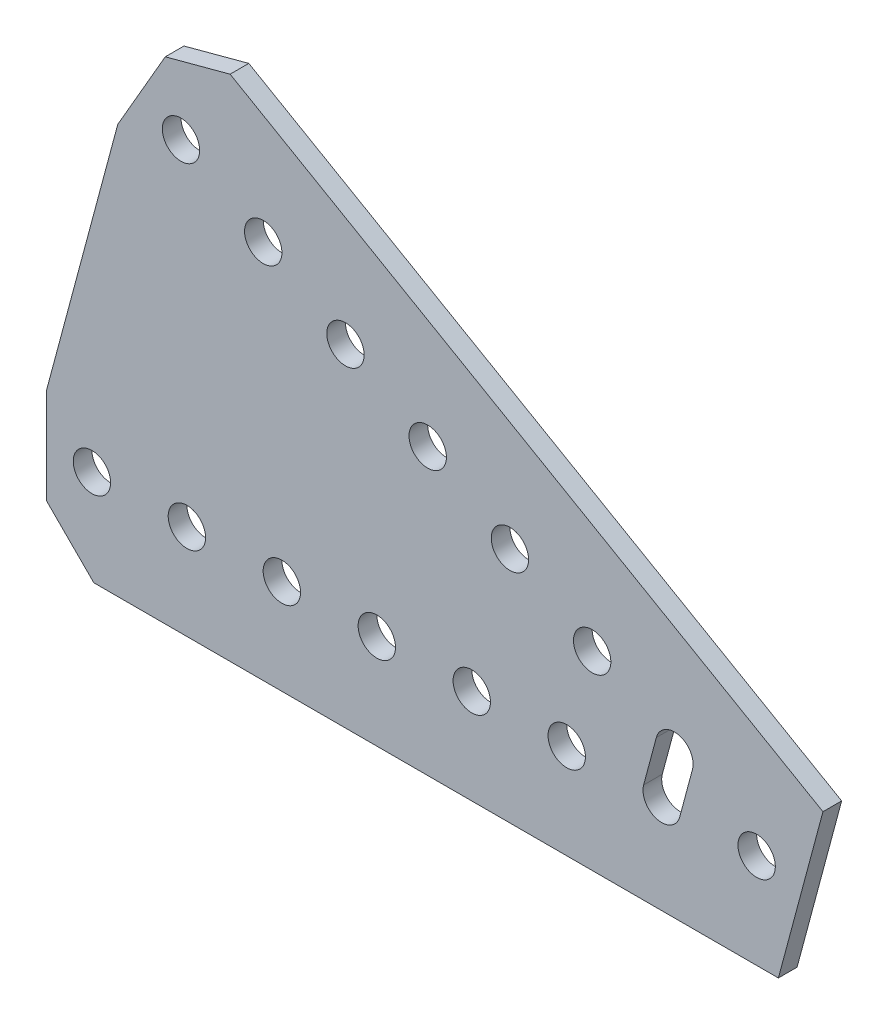
ISO-10303-21;
HEADER;
FILE_DESCRIPTION(('STEP AP214'),'2;1');
FILE_NAME('part.step','',(''),(''),'','','');
FILE_SCHEMA(('AUTOMOTIVE_DESIGN { 1 0 10303 214 1 1 1 1 }'));
ENDSEC;
DATA;
#1=APPLICATION_CONTEXT('core data for automotive mechanical design processes');
#2=APPLICATION_PROTOCOL_DEFINITION('international standard','automotive_design',2000,#1);
#3=PRODUCT_CONTEXT('',#1,'mechanical');
#4=PRODUCT('Part','Part','',(#3));
#5=PRODUCT_RELATED_PRODUCT_CATEGORY('part','',(#4));
#6=PRODUCT_DEFINITION_FORMATION('','',#4);
#7=PRODUCT_DEFINITION_CONTEXT('part definition',#1,'design');
#8=PRODUCT_DEFINITION('design','',#6,#7);
#9=PRODUCT_DEFINITION_SHAPE('','',#8);
#10=(LENGTH_UNIT() NAMED_UNIT(*) SI_UNIT(.MILLI.,.METRE.));
#11=(NAMED_UNIT(*) PLANE_ANGLE_UNIT() SI_UNIT($,.RADIAN.));
#12=(NAMED_UNIT(*) SI_UNIT($,.STERADIAN.) SOLID_ANGLE_UNIT());
#13=UNCERTAINTY_MEASURE_WITH_UNIT(LENGTH_MEASURE(1.E-05),#10,'distance_accuracy_value','');
#14=(GEOMETRIC_REPRESENTATION_CONTEXT(3) GLOBAL_UNCERTAINTY_ASSIGNED_CONTEXT((#13)) GLOBAL_UNIT_ASSIGNED_CONTEXT((#10,
#11,#12)) REPRESENTATION_CONTEXT('',''));
#15=CARTESIAN_POINT('',(0.,0.,0.));
#16=DIRECTION('',(0.,0.,1.));
#17=DIRECTION('',(1.,0.,0.));
#18=AXIS2_PLACEMENT_3D('',#15,#16,#17);
#19=CARTESIAN_POINT('',(8.86847882221169,9.54447820211008,1.25));
#20=DIRECTION('',(0.965925826289069,-0.258819045102518,0.));
#21=DIRECTION('',(0.258819045102518,0.965925826289069,0.));
#22=AXIS2_PLACEMENT_3D('',#19,#20,#21);
#23=PLANE('',#22);
#24=DIRECTION('',(-0.258819045102518,-0.965925826289069,0.));
#25=VECTOR('',#24,1.);
#26=CARTESIAN_POINT('',(8.86847882221169,9.54447820211008,-1.25));
#27=LINE('',#26,#25);
#28=CARTESIAN_POINT('',(8.86847882221169,9.54447820211008,-1.25));
#29=VERTEX_POINT('',#28);
#30=CARTESIAN_POINT('',(2.90808885190464,-12.7,-1.25));
#31=VERTEX_POINT('',#30);
#32=EDGE_CURVE('E284',#29,#31,#27,.T.);
#33=ORIENTED_EDGE('',*,*,#32,.F.);
#34=DIRECTION('',(0.,0.,-1.));
#35=VECTOR('',#34,1.);
#36=CARTESIAN_POINT('',(8.86847882221169,9.54447820211008,1.25));
#37=LINE('',#36,#35);
#38=CARTESIAN_POINT('',(8.86847882221169,9.54447820211008,1.25));
#39=VERTEX_POINT('',#38);
#40=EDGE_CURVE('E11',#39,#29,#37,.T.);
#41=ORIENTED_EDGE('',*,*,#40,.F.);
#42=DIRECTION('',(-0.258819045102518,-0.965925826289069,0.));
#43=VECTOR('',#42,1.);
#44=CARTESIAN_POINT('',(8.86847882221169,9.54447820211008,1.25));
#45=LINE('',#44,#43);
#46=CARTESIAN_POINT('',(2.90808885190464,-12.7,1.25));
#47=VERTEX_POINT('',#46);
#48=EDGE_CURVE('E288',#39,#47,#45,.T.);
#49=ORIENTED_EDGE('',*,*,#48,.T.);
#50=DIRECTION('',(0.,0.,-1.));
#51=VECTOR('',#50,1.);
#52=CARTESIAN_POINT('',(2.90808885190464,-12.7,1.25));
#53=LINE('',#52,#51);
#54=EDGE_CURVE('E48',#47,#31,#53,.T.);
#55=ORIENTED_EDGE('',*,*,#54,.T.);
#56=EDGE_LOOP('',(#33,#41,#49,#55));
#57=FACE_BOUND('',#56,.T.);
#58=ADVANCED_FACE('F45',(#57),#23,.T.);
#59=CARTESIAN_POINT('',(-70.4196879438756,55.321522628062,1.25));
#60=DIRECTION('',(0.499999999999996,0.866025403784441,0.));
#61=DIRECTION('',(-0.866025403784441,0.499999999999996,0.));
#62=AXIS2_PLACEMENT_3D('',#59,#60,#61);
#63=PLANE('',#62);
#64=DIRECTION('',(0.866025403784441,-0.499999999999996,0.));
#65=VECTOR('',#64,1.);
#66=CARTESIAN_POINT('',(-70.4196879438756,55.321522628062,-1.25));
#67=LINE('',#66,#65);
#68=CARTESIAN_POINT('',(-70.4196879438756,55.321522628062,-1.25));
#69=VERTEX_POINT('',#68);
#70=EDGE_CURVE('E293',#69,#29,#67,.T.);
#71=ORIENTED_EDGE('',*,*,#70,.F.);
#72=DIRECTION('',(0.,0.,-1.));
#73=VECTOR('',#72,1.);
#74=CARTESIAN_POINT('',(-70.4196879438756,55.321522628062,1.25));
#75=LINE('',#74,#73);
#76=CARTESIAN_POINT('',(-70.4196879438756,55.321522628062,1.25));
#77=VERTEX_POINT('',#76);
#78=EDGE_CURVE('E54',#77,#69,#75,.T.);
#79=ORIENTED_EDGE('',*,*,#78,.F.);
#80=DIRECTION('',(0.866025403784441,-0.499999999999996,0.));
#81=VECTOR('',#80,1.);
#82=CARTESIAN_POINT('',(-70.4196879438756,55.321522628062,1.25));
#83=LINE('',#82,#81);
#84=EDGE_CURVE('E317',#77,#39,#83,.T.);
#85=ORIENTED_EDGE('',*,*,#84,.T.);
#86=ORIENTED_EDGE('',*,*,#40,.T.);
#87=EDGE_LOOP('',(#71,#79,#85,#86));
#88=FACE_BOUND('',#87,.T.);
#89=ADVANCED_FACE('F380',(#88),#63,.T.);
#90=CARTESIAN_POINT('',(-79.0939492579068,52.9972613140307,1.25));
#91=DIRECTION('',(-0.258819045102532,0.965925826289065,0.));
#92=DIRECTION('',(-0.965925826289065,-0.258819045102532,0.));
#93=AXIS2_PLACEMENT_3D('',#90,#91,#92);
#94=PLANE('',#93);
#95=DIRECTION('',(0.965925826289065,0.258819045102532,0.));
#96=VECTOR('',#95,1.);
#97=CARTESIAN_POINT('',(-79.0939492579068,52.9972613140307,-1.25));
#98=LINE('',#97,#96);
#99=CARTESIAN_POINT('',(-79.0939492579068,52.9972613140307,-1.25));
#100=VERTEX_POINT('',#99);
#101=EDGE_CURVE('E344',#100,#69,#98,.T.);
#102=ORIENTED_EDGE('',*,*,#101,.F.);
#103=DIRECTION('',(0.,0.,-1.));
#104=VECTOR('',#103,1.);
#105=CARTESIAN_POINT('',(-79.0939492579068,52.9972613140307,1.25));
#106=LINE('',#105,#104);
#107=CARTESIAN_POINT('',(-79.0939492579068,52.9972613140307,1.25));
#108=VERTEX_POINT('',#107);
#109=EDGE_CURVE('E353',#108,#100,#106,.T.);
#110=ORIENTED_EDGE('',*,*,#109,.F.);
#111=DIRECTION('',(0.965925826289065,0.258819045102532,0.));
#112=VECTOR('',#111,1.);
#113=CARTESIAN_POINT('',(-79.0939492579068,52.9972613140307,1.25));
#114=LINE('',#113,#112);
#115=EDGE_CURVE('E313',#108,#77,#114,.T.);
#116=ORIENTED_EDGE('',*,*,#115,.T.);
#117=ORIENTED_EDGE('',*,*,#78,.T.);
#118=EDGE_LOOP('',(#102,#110,#116,#117));
#119=FACE_BOUND('',#118,.T.);
#120=ADVANCED_FACE('F400',(#119),#94,.T.);
#121=CARTESIAN_POINT('',(-85.4439492579066,41.9987386859683,1.25));
#122=DIRECTION('',(-0.866025403784447,0.499999999999985,0.));
#123=DIRECTION('',(-0.499999999999985,-0.866025403784447,0.));
#124=AXIS2_PLACEMENT_3D('',#121,#122,#123);
#125=PLANE('',#124);
#126=DIRECTION('',(0.499999999999985,0.866025403784447,0.));
#127=VECTOR('',#126,1.);
#128=CARTESIAN_POINT('',(-85.4439492579066,41.9987386859683,-1.25));
#129=LINE('',#128,#127);
#130=CARTESIAN_POINT('',(-85.4439492579066,41.9987386859683,-1.25));
#131=VERTEX_POINT('',#130);
#132=EDGE_CURVE('E340',#131,#100,#129,.T.);
#133=ORIENTED_EDGE('',*,*,#132,.F.);
#134=DIRECTION('',(0.,0.,-1.));
#135=VECTOR('',#134,1.);
#136=CARTESIAN_POINT('',(-85.4439492579066,41.9987386859683,1.25));
#137=LINE('',#136,#135);
#138=CARTESIAN_POINT('',(-85.4439492579066,41.9987386859683,1.25));
#139=VERTEX_POINT('',#138);
#140=EDGE_CURVE('E356',#139,#131,#137,.T.);
#141=ORIENTED_EDGE('',*,*,#140,.F.);
#142=DIRECTION('',(0.499999999999985,0.866025403784447,0.));
#143=VECTOR('',#142,1.);
#144=CARTESIAN_POINT('',(-85.4439492579066,41.9987386859683,1.25));
#145=LINE('',#144,#143);
#146=EDGE_CURVE('E309',#139,#108,#145,.T.);
#147=ORIENTED_EDGE('',*,*,#146,.T.);
#148=ORIENTED_EDGE('',*,*,#109,.T.);
#149=EDGE_LOOP('',(#133,#141,#147,#148));
#150=FACE_BOUND('',#149,.T.);
#151=ADVANCED_FACE('F398',(#150),#125,.T.);
#152=CARTESIAN_POINT('',(-94.996,6.35,1.25));
#153=DIRECTION('',(-0.965925826289068,0.258819045102523,0.));
#154=DIRECTION('',(-0.258819045102523,-0.965925826289068,0.));
#155=AXIS2_PLACEMENT_3D('',#152,#153,#154);
#156=PLANE('',#155);
#157=DIRECTION('',(0.258819045102523,0.965925826289068,0.));
#158=VECTOR('',#157,1.);
#159=CARTESIAN_POINT('',(-94.996,6.35,-1.25));
#160=LINE('',#159,#158);
#161=CARTESIAN_POINT('',(-94.996,6.35,-1.25));
#162=VERTEX_POINT('',#161);
#163=EDGE_CURVE('E336',#162,#131,#160,.T.);
#164=ORIENTED_EDGE('',*,*,#163,.F.);
#165=DIRECTION('',(0.,0.,-1.));
#166=VECTOR('',#165,1.);
#167=CARTESIAN_POINT('',(-94.996,6.35,1.25));
#168=LINE('',#167,#166);
#169=CARTESIAN_POINT('',(-94.996,6.35,1.25));
#170=VERTEX_POINT('',#169);
#171=EDGE_CURVE('E359',#170,#162,#168,.T.);
#172=ORIENTED_EDGE('',*,*,#171,.F.);
#173=DIRECTION('',(0.258819045102523,0.965925826289068,0.));
#174=VECTOR('',#173,1.);
#175=CARTESIAN_POINT('',(-94.996,6.35,1.25));
#176=LINE('',#175,#174);
#177=EDGE_CURVE('E305',#170,#139,#176,.T.);
#178=ORIENTED_EDGE('',*,*,#177,.T.);
#179=ORIENTED_EDGE('',*,*,#140,.T.);
#180=EDGE_LOOP('',(#164,#172,#178,#179));
#181=FACE_BOUND('',#180,.T.);
#182=ADVANCED_FACE('F394',(#181),#156,.T.);
#183=CARTESIAN_POINT('',(-94.996,-6.35,1.25));
#184=DIRECTION('',(-1.,0.,0.));
#185=DIRECTION('',(0.,0.,1.));
#186=AXIS2_PLACEMENT_3D('',#183,#184,#185);
#187=PLANE('',#186);
#188=DIRECTION('',(0.,1.,0.));
#189=VECTOR('',#188,1.);
#190=CARTESIAN_POINT('',(-94.996,-6.35,-1.25));
#191=LINE('',#190,#189);
#192=CARTESIAN_POINT('',(-94.996,-6.35,-1.25));
#193=VERTEX_POINT('',#192);
#194=EDGE_CURVE('E332',#193,#162,#191,.T.);
#195=ORIENTED_EDGE('',*,*,#194,.F.);
#196=DIRECTION('',(0.,0.,-1.));
#197=VECTOR('',#196,1.);
#198=CARTESIAN_POINT('',(-94.996,-6.35,1.25));
#199=LINE('',#198,#197);
#200=CARTESIAN_POINT('',(-94.996,-6.35,1.25));
#201=VERTEX_POINT('',#200);
#202=EDGE_CURVE('E362',#201,#193,#199,.T.);
#203=ORIENTED_EDGE('',*,*,#202,.F.);
#204=DIRECTION('',(0.,1.,0.));
#205=VECTOR('',#204,1.);
#206=CARTESIAN_POINT('',(-94.996,-6.35,1.25));
#207=LINE('',#206,#205);
#208=EDGE_CURVE('E301',#201,#170,#207,.T.);
#209=ORIENTED_EDGE('',*,*,#208,.T.);
#210=ORIENTED_EDGE('',*,*,#171,.T.);
#211=EDGE_LOOP('',(#195,#203,#209,#210));
#212=FACE_BOUND('',#211,.T.);
#213=ADVANCED_FACE('F392',(#212),#187,.T.);
#214=CARTESIAN_POINT('',(-88.646,-12.7,1.25));
#215=DIRECTION('',(-0.707106781186548,-0.707106781186547,0.));
#216=DIRECTION('',(0.707106781186547,-0.707106781186548,0.));
#217=AXIS2_PLACEMENT_3D('',#214,#215,#216);
#218=PLANE('',#217);
#219=DIRECTION('',(-0.707106781186547,0.707106781186548,0.));
#220=VECTOR('',#219,1.);
#221=CARTESIAN_POINT('',(-88.646,-12.7,-1.25));
#222=LINE('',#221,#220);
#223=CARTESIAN_POINT('',(-88.646,-12.7,-1.25));
#224=VERTEX_POINT('',#223);
#225=EDGE_CURVE('E328',#224,#193,#222,.T.);
#226=ORIENTED_EDGE('',*,*,#225,.F.);
#227=DIRECTION('',(0.,0.,-1.));
#228=VECTOR('',#227,1.);
#229=CARTESIAN_POINT('',(-88.646,-12.7,1.25));
#230=LINE('',#229,#228);
#231=CARTESIAN_POINT('',(-88.646,-12.7,1.25));
#232=VERTEX_POINT('',#231);
#233=EDGE_CURVE('E364',#232,#224,#230,.T.);
#234=ORIENTED_EDGE('',*,*,#233,.F.);
#235=DIRECTION('',(-0.707106781186547,0.707106781186548,0.));
#236=VECTOR('',#235,1.);
#237=CARTESIAN_POINT('',(-88.646,-12.7,1.25));
#238=LINE('',#237,#236);
#239=EDGE_CURVE('E297',#232,#201,#238,.T.);
#240=ORIENTED_EDGE('',*,*,#239,.T.);
#241=ORIENTED_EDGE('',*,*,#202,.T.);
#242=EDGE_LOOP('',(#226,#234,#240,#241));
#243=FACE_BOUND('',#242,.T.);
#244=ADVANCED_FACE('F388',(#243),#218,.T.);
#245=CARTESIAN_POINT('',(2.90808885190464,-12.7,1.25));
#246=DIRECTION('',(0.,-1.,0.));
#247=DIRECTION('',(0.,0.,-1.));
#248=AXIS2_PLACEMENT_3D('',#245,#246,#247);
#249=PLANE('',#248);
#250=DIRECTION('',(-1.,0.,0.));
#251=VECTOR('',#250,1.);
#252=CARTESIAN_POINT('',(2.90808885190464,-12.7,-1.25));
#253=LINE('',#252,#251);
#254=EDGE_CURVE('E324',#31,#224,#253,.T.);
#255=ORIENTED_EDGE('',*,*,#254,.F.);
#256=ORIENTED_EDGE('',*,*,#54,.F.);
#257=DIRECTION('',(-1.,0.,0.));
#258=VECTOR('',#257,1.);
#259=CARTESIAN_POINT('',(2.90808885190464,-12.7,1.25));
#260=LINE('',#259,#258);
#261=EDGE_CURVE('E292',#47,#232,#260,.T.);
#262=ORIENTED_EDGE('',*,*,#261,.T.);
#263=ORIENTED_EDGE('',*,*,#233,.T.);
#264=EDGE_LOOP('',(#255,#256,#262,#263));
#265=FACE_BOUND('',#264,.T.);
#266=ADVANCED_FACE('F374',(#265),#249,.T.);
#267=CARTESIAN_POINT('',(0.,0.,1.25));
#268=DIRECTION('',(0.,0.,-1.));
#269=DIRECTION('',(-1.,0.,0.));
#270=AXIS2_PLACEMENT_3D('',#267,#268,#269);
#271=PLANE('',#270);
#272=DIRECTION('',(-0.258819045102541,-0.965925826289063,0.));
#273=VECTOR('',#272,1.);
#274=CARTESIAN_POINT('',(-10.2851854342774,-0.647047612756359,1.25));
#275=LINE('',#274,#273);
#276=CARTESIAN_POINT('',(-8.58370806233947,5.70295238724404,1.25));
#277=VERTEX_POINT('',#276);
#278=CARTESIAN_POINT('',(-10.2851854342774,-0.647047612756359,1.25));
#279=VERTEX_POINT('',#278);
#280=EDGE_CURVE('E144',#277,#279,#275,.T.);
#281=ORIENTED_EDGE('',*,*,#280,.T.);
#282=CARTESIAN_POINT('',(-12.7,0.,1.25));
#283=DIRECTION('',(0.,0.,-1.));
#284=DIRECTION('',(1.,0.,0.));
#285=AXIS2_PLACEMENT_3D('',#282,#283,#284);
#286=CIRCLE('',#285,2.49999999999999);
#287=CARTESIAN_POINT('',(-15.1148145657227,0.647047612756338,1.25));
#288=VERTEX_POINT('',#287);
#289=EDGE_CURVE('E137',#279,#288,#286,.T.);
#290=ORIENTED_EDGE('',*,*,#289,.T.);
#291=DIRECTION('',(0.25881904510254,0.965925826289063,0.));
#292=VECTOR('',#291,1.);
#293=CARTESIAN_POINT('',(-13.4133371937848,6.99704761275674,1.25));
#294=LINE('',#293,#292);
#295=CARTESIAN_POINT('',(-13.4133371937848,6.99704761275674,1.25));
#296=VERTEX_POINT('',#295);
#297=EDGE_CURVE('E147',#288,#296,#294,.T.);
#298=ORIENTED_EDGE('',*,*,#297,.T.);
#299=CARTESIAN_POINT('',(-10.9985226280621,6.35000000000039,1.25));
#300=DIRECTION('',(0.,0.,-1.));
#301=DIRECTION('',(1.,0.,0.));
#302=AXIS2_PLACEMENT_3D('',#299,#300,#301);
#303=CIRCLE('',#302,2.49999999999999);
#304=EDGE_CURVE('E62',#296,#277,#303,.T.);
#305=ORIENTED_EDGE('',*,*,#304,.T.);
#306=EDGE_LOOP('',(#281,#290,#298,#305));
#307=FACE_BOUND('',#306,.T.);
#308=CARTESIAN_POINT('',(-21.9970452561245,12.7000000000003,1.25));
#309=DIRECTION('',(0.,0.,-1.));
#310=DIRECTION('',(1.,0.,0.));
#311=AXIS2_PLACEMENT_3D('',#308,#309,#310);
#312=CIRCLE('',#311,2.5);
#313=CARTESIAN_POINT('',(-19.4970452561246,12.7000000000003,1.25));
#314=VERTEX_POINT('',#313);
#315=EDGE_CURVE('E184',#314,#314,#312,.T.);
#316=ORIENTED_EDGE('',*,*,#315,.T.);
#317=EDGE_LOOP('',(#316));
#318=FACE_BOUND('',#317,.T.);
#319=CARTESIAN_POINT('',(-32.9955678841869,19.0500000000002,1.25));
#320=DIRECTION('',(0.,0.,-1.));
#321=DIRECTION('',(1.,0.,0.));
#322=AXIS2_PLACEMENT_3D('',#319,#320,#321);
#323=CIRCLE('',#322,2.5);
#324=CARTESIAN_POINT('',(-30.495567884187,19.0500000000002,1.25));
#325=VERTEX_POINT('',#324);
#326=EDGE_CURVE('E192',#325,#325,#323,.T.);
#327=ORIENTED_EDGE('',*,*,#326,.T.);
#328=EDGE_LOOP('',(#327));
#329=FACE_BOUND('',#328,.T.);
#330=CARTESIAN_POINT('',(-43.9940905122493,25.4,1.25));
#331=DIRECTION('',(0.,0.,-1.));
#332=DIRECTION('',(1.,0.,0.));
#333=AXIS2_PLACEMENT_3D('',#330,#331,#332);
#334=CIRCLE('',#333,2.5);
#335=CARTESIAN_POINT('',(-41.4940905122493,25.4,1.25));
#336=VERTEX_POINT('',#335);
#337=EDGE_CURVE('E200',#336,#336,#334,.T.);
#338=ORIENTED_EDGE('',*,*,#337,.T.);
#339=EDGE_LOOP('',(#338));
#340=FACE_BOUND('',#339,.T.);
#341=CARTESIAN_POINT('',(-54.9926131403118,31.75,1.25));
#342=DIRECTION('',(0.,0.,-1.));
#343=DIRECTION('',(1.,0.,0.));
#344=AXIS2_PLACEMENT_3D('',#341,#342,#343);
#345=CIRCLE('',#344,2.5);
#346=CARTESIAN_POINT('',(-52.4926131403118,31.75,1.25));
#347=VERTEX_POINT('',#346);
#348=EDGE_CURVE('E208',#347,#347,#345,.T.);
#349=ORIENTED_EDGE('',*,*,#348,.T.);
#350=EDGE_LOOP('',(#349));
#351=FACE_BOUND('',#350,.T.);
#352=CARTESIAN_POINT('',(-65.9911357683742,38.1,1.25));
#353=DIRECTION('',(0.,0.,-1.));
#354=DIRECTION('',(1.,0.,0.));
#355=AXIS2_PLACEMENT_3D('',#352,#353,#354);
#356=CIRCLE('',#355,2.5);
#357=CARTESIAN_POINT('',(-63.4911357683742,38.1,1.25));
#358=VERTEX_POINT('',#357);
#359=EDGE_CURVE('E216',#358,#358,#356,.T.);
#360=ORIENTED_EDGE('',*,*,#359,.T.);
#361=EDGE_LOOP('',(#360));
#362=FACE_BOUND('',#361,.T.);
#363=CARTESIAN_POINT('',(-76.9896583964366,44.45,1.25));
#364=DIRECTION('',(0.,0.,-1.));
#365=DIRECTION('',(1.,0.,0.));
#366=AXIS2_PLACEMENT_3D('',#363,#364,#365);
#367=CIRCLE('',#366,2.5);
#368=CARTESIAN_POINT('',(-74.4896583964366,44.45,1.25));
#369=VERTEX_POINT('',#368);
#370=EDGE_CURVE('E224',#369,#369,#367,.T.);
#371=ORIENTED_EDGE('',*,*,#370,.T.);
#372=EDGE_LOOP('',(#371));
#373=FACE_BOUND('',#372,.T.);
#374=CARTESIAN_POINT('',(-76.2,0.,1.25));
#375=DIRECTION('',(0.,0.,-1.));
#376=DIRECTION('',(1.,0.,0.));
#377=AXIS2_PLACEMENT_3D('',#374,#375,#376);
#378=CIRCLE('',#377,2.5);
#379=CARTESIAN_POINT('',(-73.7,0.,1.25));
#380=VERTEX_POINT('',#379);
#381=EDGE_CURVE('E232',#380,#380,#378,.T.);
#382=ORIENTED_EDGE('',*,*,#381,.T.);
#383=EDGE_LOOP('',(#382));
#384=FACE_BOUND('',#383,.T.);
#385=CARTESIAN_POINT('',(-88.9,0.,1.25));
#386=DIRECTION('',(0.,0.,-1.));
#387=DIRECTION('',(1.,0.,0.));
#388=AXIS2_PLACEMENT_3D('',#385,#386,#387);
#389=CIRCLE('',#388,2.5);
#390=CARTESIAN_POINT('',(-86.4,0.,1.25));
#391=VERTEX_POINT('',#390);
#392=EDGE_CURVE('E240',#391,#391,#389,.T.);
#393=ORIENTED_EDGE('',*,*,#392,.T.);
#394=EDGE_LOOP('',(#393));
#395=FACE_BOUND('',#394,.T.);
#396=CARTESIAN_POINT('',(0.,0.,1.25));
#397=DIRECTION('',(0.,0.,-1.));
#398=DIRECTION('',(1.,0.,0.));
#399=AXIS2_PLACEMENT_3D('',#396,#397,#398);
#400=CIRCLE('',#399,2.5);
#401=CARTESIAN_POINT('',(2.5,0.,1.25));
#402=VERTEX_POINT('',#401);
#403=EDGE_CURVE('E248',#402,#402,#400,.T.);
#404=ORIENTED_EDGE('',*,*,#403,.T.);
#405=EDGE_LOOP('',(#404));
#406=FACE_BOUND('',#405,.T.);
#407=CARTESIAN_POINT('',(-63.5,0.,1.25));
#408=DIRECTION('',(0.,0.,-1.));
#409=DIRECTION('',(1.,0.,0.));
#410=AXIS2_PLACEMENT_3D('',#407,#408,#409);
#411=CIRCLE('',#410,2.5);
#412=CARTESIAN_POINT('',(-61.,0.,1.25));
#413=VERTEX_POINT('',#412);
#414=EDGE_CURVE('E256',#413,#413,#411,.T.);
#415=ORIENTED_EDGE('',*,*,#414,.T.);
#416=EDGE_LOOP('',(#415));
#417=FACE_BOUND('',#416,.T.);
#418=CARTESIAN_POINT('',(-50.8,0.,1.25));
#419=DIRECTION('',(0.,0.,-1.));
#420=DIRECTION('',(1.,0.,0.));
#421=AXIS2_PLACEMENT_3D('',#418,#419,#420);
#422=CIRCLE('',#421,2.5);
#423=CARTESIAN_POINT('',(-48.3,0.,1.25));
#424=VERTEX_POINT('',#423);
#425=EDGE_CURVE('E264',#424,#424,#422,.T.);
#426=ORIENTED_EDGE('',*,*,#425,.T.);
#427=EDGE_LOOP('',(#426));
#428=FACE_BOUND('',#427,.T.);
#429=CARTESIAN_POINT('',(-38.1,0.,1.25));
#430=DIRECTION('',(0.,0.,-1.));
#431=DIRECTION('',(1.,0.,0.));
#432=AXIS2_PLACEMENT_3D('',#429,#430,#431);
#433=CIRCLE('',#432,2.5);
#434=CARTESIAN_POINT('',(-35.6,0.,1.25));
#435=VERTEX_POINT('',#434);
#436=EDGE_CURVE('E272',#435,#435,#433,.T.);
#437=ORIENTED_EDGE('',*,*,#436,.T.);
#438=EDGE_LOOP('',(#437));
#439=FACE_BOUND('',#438,.T.);
#440=CARTESIAN_POINT('',(-25.4,0.,1.25));
#441=DIRECTION('',(0.,0.,-1.));
#442=DIRECTION('',(1.,0.,0.));
#443=AXIS2_PLACEMENT_3D('',#440,#441,#442);
#444=CIRCLE('',#443,2.5);
#445=CARTESIAN_POINT('',(-22.9,0.,1.25));
#446=VERTEX_POINT('',#445);
#447=EDGE_CURVE('E280',#446,#446,#444,.T.);
#448=ORIENTED_EDGE('',*,*,#447,.T.);
#449=EDGE_LOOP('',(#448));
#450=FACE_BOUND('',#449,.T.);
#451=ORIENTED_EDGE('',*,*,#48,.F.);
#452=ORIENTED_EDGE('',*,*,#84,.F.);
#453=ORIENTED_EDGE('',*,*,#115,.F.);
#454=ORIENTED_EDGE('',*,*,#146,.F.);
#455=ORIENTED_EDGE('',*,*,#177,.F.);
#456=ORIENTED_EDGE('',*,*,#208,.F.);
#457=ORIENTED_EDGE('',*,*,#239,.F.);
#458=ORIENTED_EDGE('',*,*,#261,.F.);
#459=EDGE_LOOP('',(#451,#452,#453,#454,#455,#456,#457,#458));
#460=FACE_BOUND('',#459,.T.);
#461=ADVANCED_FACE('F152',(#307,#318,#329,#340,#351,#362,#373,#384,#395,#406,#417,#428,#439,
#450,#460),#271,.F.);
#462=CARTESIAN_POINT('',(0.,0.,-1.25));
#463=DIRECTION('',(0.,0.,-1.));
#464=DIRECTION('',(-1.,0.,0.));
#465=AXIS2_PLACEMENT_3D('',#462,#463,#464);
#466=PLANE('',#465);
#467=CARTESIAN_POINT('',(-12.7,0.,-1.25));
#468=DIRECTION('',(0.,0.,-1.));
#469=DIRECTION('',(1.,0.,0.));
#470=AXIS2_PLACEMENT_3D('',#467,#468,#469);
#471=CIRCLE('',#470,2.49999999999999);
#472=CARTESIAN_POINT('',(-10.2851854342774,-0.647047612756359,-1.25));
#473=VERTEX_POINT('',#472);
#474=CARTESIAN_POINT('',(-15.1148145657227,0.647047612756338,-1.25));
#475=VERTEX_POINT('',#474);
#476=EDGE_CURVE('E70',#473,#475,#471,.T.);
#477=ORIENTED_EDGE('',*,*,#476,.F.);
#478=DIRECTION('',(-0.258819045102541,-0.965925826289063,0.));
#479=VECTOR('',#478,1.);
#480=CARTESIAN_POINT('',(-10.2851854342774,-0.647047612756359,-1.25));
#481=LINE('',#480,#479);
#482=CARTESIAN_POINT('',(-8.58370806233947,5.70295238724404,-1.25));
#483=VERTEX_POINT('',#482);
#484=EDGE_CURVE('E156',#483,#473,#481,.T.);
#485=ORIENTED_EDGE('',*,*,#484,.F.);
#486=CARTESIAN_POINT('',(-10.9985226280621,6.35000000000039,-1.25));
#487=DIRECTION('',(0.,0.,-1.));
#488=DIRECTION('',(1.,0.,0.));
#489=AXIS2_PLACEMENT_3D('',#486,#487,#488);
#490=CIRCLE('',#489,2.49999999999999);
#491=CARTESIAN_POINT('',(-13.4133371937848,6.99704761275674,-1.25));
#492=VERTEX_POINT('',#491);
#493=EDGE_CURVE('E160',#492,#483,#490,.T.);
#494=ORIENTED_EDGE('',*,*,#493,.F.);
#495=DIRECTION('',(0.25881904510254,0.965925826289063,0.));
#496=VECTOR('',#495,1.);
#497=CARTESIAN_POINT('',(-13.4133371937848,6.99704761275674,-1.25));
#498=LINE('',#497,#496);
#499=EDGE_CURVE('E169',#475,#492,#498,.T.);
#500=ORIENTED_EDGE('',*,*,#499,.F.);
#501=EDGE_LOOP('',(#477,#485,#494,#500));
#502=FACE_BOUND('',#501,.T.);
#503=CARTESIAN_POINT('',(-21.9970452561245,12.7000000000003,-1.25));
#504=DIRECTION('',(0.,0.,-1.));
#505=DIRECTION('',(1.,0.,0.));
#506=AXIS2_PLACEMENT_3D('',#503,#504,#505);
#507=CIRCLE('',#506,2.5);
#508=CARTESIAN_POINT('',(-19.4970452561246,12.7000000000003,-1.25));
#509=VERTEX_POINT('',#508);
#510=EDGE_CURVE('E178',#509,#509,#507,.T.);
#511=ORIENTED_EDGE('',*,*,#510,.F.);
#512=EDGE_LOOP('',(#511));
#513=FACE_BOUND('',#512,.T.);
#514=CARTESIAN_POINT('',(-32.9955678841869,19.0500000000002,-1.25));
#515=DIRECTION('',(0.,0.,-1.));
#516=DIRECTION('',(1.,0.,0.));
#517=AXIS2_PLACEMENT_3D('',#514,#515,#516);
#518=CIRCLE('',#517,2.5);
#519=CARTESIAN_POINT('',(-30.495567884187,19.0500000000002,-1.25));
#520=VERTEX_POINT('',#519);
#521=EDGE_CURVE('E188',#520,#520,#518,.T.);
#522=ORIENTED_EDGE('',*,*,#521,.F.);
#523=EDGE_LOOP('',(#522));
#524=FACE_BOUND('',#523,.T.);
#525=CARTESIAN_POINT('',(-43.9940905122493,25.4,-1.25));
#526=DIRECTION('',(0.,0.,-1.));
#527=DIRECTION('',(1.,0.,0.));
#528=AXIS2_PLACEMENT_3D('',#525,#526,#527);
#529=CIRCLE('',#528,2.5);
#530=CARTESIAN_POINT('',(-41.4940905122493,25.4,-1.25));
#531=VERTEX_POINT('',#530);
#532=EDGE_CURVE('E196',#531,#531,#529,.T.);
#533=ORIENTED_EDGE('',*,*,#532,.F.);
#534=EDGE_LOOP('',(#533));
#535=FACE_BOUND('',#534,.T.);
#536=CARTESIAN_POINT('',(-54.9926131403118,31.75,-1.25));
#537=DIRECTION('',(0.,0.,-1.));
#538=DIRECTION('',(1.,0.,0.));
#539=AXIS2_PLACEMENT_3D('',#536,#537,#538);
#540=CIRCLE('',#539,2.5);
#541=CARTESIAN_POINT('',(-52.4926131403118,31.75,-1.25));
#542=VERTEX_POINT('',#541);
#543=EDGE_CURVE('E204',#542,#542,#540,.T.);
#544=ORIENTED_EDGE('',*,*,#543,.F.);
#545=EDGE_LOOP('',(#544));
#546=FACE_BOUND('',#545,.T.);
#547=CARTESIAN_POINT('',(-65.9911357683742,38.1,-1.25));
#548=DIRECTION('',(0.,0.,-1.));
#549=DIRECTION('',(1.,0.,0.));
#550=AXIS2_PLACEMENT_3D('',#547,#548,#549);
#551=CIRCLE('',#550,2.5);
#552=CARTESIAN_POINT('',(-63.4911357683742,38.1,-1.25));
#553=VERTEX_POINT('',#552);
#554=EDGE_CURVE('E212',#553,#553,#551,.T.);
#555=ORIENTED_EDGE('',*,*,#554,.F.);
#556=EDGE_LOOP('',(#555));
#557=FACE_BOUND('',#556,.T.);
#558=CARTESIAN_POINT('',(-76.9896583964366,44.45,-1.25));
#559=DIRECTION('',(0.,0.,-1.));
#560=DIRECTION('',(1.,0.,0.));
#561=AXIS2_PLACEMENT_3D('',#558,#559,#560);
#562=CIRCLE('',#561,2.5);
#563=CARTESIAN_POINT('',(-74.4896583964366,44.45,-1.25));
#564=VERTEX_POINT('',#563);
#565=EDGE_CURVE('E220',#564,#564,#562,.T.);
#566=ORIENTED_EDGE('',*,*,#565,.F.);
#567=EDGE_LOOP('',(#566));
#568=FACE_BOUND('',#567,.T.);
#569=CARTESIAN_POINT('',(-76.2,0.,-1.25));
#570=DIRECTION('',(0.,0.,-1.));
#571=DIRECTION('',(1.,0.,0.));
#572=AXIS2_PLACEMENT_3D('',#569,#570,#571);
#573=CIRCLE('',#572,2.5);
#574=CARTESIAN_POINT('',(-73.7,0.,-1.25));
#575=VERTEX_POINT('',#574);
#576=EDGE_CURVE('E228',#575,#575,#573,.T.);
#577=ORIENTED_EDGE('',*,*,#576,.F.);
#578=EDGE_LOOP('',(#577));
#579=FACE_BOUND('',#578,.T.);
#580=CARTESIAN_POINT('',(-88.9,0.,-1.25));
#581=DIRECTION('',(0.,0.,-1.));
#582=DIRECTION('',(1.,0.,0.));
#583=AXIS2_PLACEMENT_3D('',#580,#581,#582);
#584=CIRCLE('',#583,2.5);
#585=CARTESIAN_POINT('',(-86.4,0.,-1.25));
#586=VERTEX_POINT('',#585);
#587=EDGE_CURVE('E236',#586,#586,#584,.T.);
#588=ORIENTED_EDGE('',*,*,#587,.F.);
#589=EDGE_LOOP('',(#588));
#590=FACE_BOUND('',#589,.T.);
#591=CARTESIAN_POINT('',(0.,0.,-1.25));
#592=DIRECTION('',(0.,0.,-1.));
#593=DIRECTION('',(1.,0.,0.));
#594=AXIS2_PLACEMENT_3D('',#591,#592,#593);
#595=CIRCLE('',#594,2.5);
#596=CARTESIAN_POINT('',(2.5,0.,-1.25));
#597=VERTEX_POINT('',#596);
#598=EDGE_CURVE('E244',#597,#597,#595,.T.);
#599=ORIENTED_EDGE('',*,*,#598,.F.);
#600=EDGE_LOOP('',(#599));
#601=FACE_BOUND('',#600,.T.);
#602=CARTESIAN_POINT('',(-63.5,0.,-1.25));
#603=DIRECTION('',(0.,0.,-1.));
#604=DIRECTION('',(1.,0.,0.));
#605=AXIS2_PLACEMENT_3D('',#602,#603,#604);
#606=CIRCLE('',#605,2.5);
#607=CARTESIAN_POINT('',(-61.,0.,-1.25));
#608=VERTEX_POINT('',#607);
#609=EDGE_CURVE('E252',#608,#608,#606,.T.);
#610=ORIENTED_EDGE('',*,*,#609,.F.);
#611=EDGE_LOOP('',(#610));
#612=FACE_BOUND('',#611,.T.);
#613=CARTESIAN_POINT('',(-50.8,0.,-1.25));
#614=DIRECTION('',(0.,0.,-1.));
#615=DIRECTION('',(1.,0.,0.));
#616=AXIS2_PLACEMENT_3D('',#613,#614,#615);
#617=CIRCLE('',#616,2.5);
#618=CARTESIAN_POINT('',(-48.3,0.,-1.25));
#619=VERTEX_POINT('',#618);
#620=EDGE_CURVE('E260',#619,#619,#617,.T.);
#621=ORIENTED_EDGE('',*,*,#620,.F.);
#622=EDGE_LOOP('',(#621));
#623=FACE_BOUND('',#622,.T.);
#624=CARTESIAN_POINT('',(-38.1,0.,-1.25));
#625=DIRECTION('',(0.,0.,-1.));
#626=DIRECTION('',(1.,0.,0.));
#627=AXIS2_PLACEMENT_3D('',#624,#625,#626);
#628=CIRCLE('',#627,2.5);
#629=CARTESIAN_POINT('',(-35.6,0.,-1.25));
#630=VERTEX_POINT('',#629);
#631=EDGE_CURVE('E268',#630,#630,#628,.T.);
#632=ORIENTED_EDGE('',*,*,#631,.F.);
#633=EDGE_LOOP('',(#632));
#634=FACE_BOUND('',#633,.T.);
#635=CARTESIAN_POINT('',(-25.4,0.,-1.25));
#636=DIRECTION('',(0.,0.,-1.));
#637=DIRECTION('',(1.,0.,0.));
#638=AXIS2_PLACEMENT_3D('',#635,#636,#637);
#639=CIRCLE('',#638,2.5);
#640=CARTESIAN_POINT('',(-22.9,0.,-1.25));
#641=VERTEX_POINT('',#640);
#642=EDGE_CURVE('E276',#641,#641,#639,.T.);
#643=ORIENTED_EDGE('',*,*,#642,.F.);
#644=EDGE_LOOP('',(#643));
#645=FACE_BOUND('',#644,.T.);
#646=ORIENTED_EDGE('',*,*,#32,.T.);
#647=ORIENTED_EDGE('',*,*,#254,.T.);
#648=ORIENTED_EDGE('',*,*,#225,.T.);
#649=ORIENTED_EDGE('',*,*,#194,.T.);
#650=ORIENTED_EDGE('',*,*,#163,.T.);
#651=ORIENTED_EDGE('',*,*,#132,.T.);
#652=ORIENTED_EDGE('',*,*,#101,.T.);
#653=ORIENTED_EDGE('',*,*,#70,.T.);
#654=EDGE_LOOP('',(#646,#647,#648,#649,#650,#651,#652,#653));
#655=FACE_BOUND('',#654,.T.);
#656=ADVANCED_FACE('F376',(#502,#513,#524,#535,#546,#557,#568,#579,#590,#601,#612,#623,#634,
#645,#655),#466,.T.);
#657=CARTESIAN_POINT('',(-25.4,0.,1.25));
#658=DIRECTION('',(0.,0.,-1.));
#659=DIRECTION('',(-1.,0.,0.));
#660=AXIS2_PLACEMENT_3D('',#657,#658,#659);
#661=CYLINDRICAL_SURFACE('',#660,2.5);
#662=ORIENTED_EDGE('',*,*,#447,.F.);
#663=EDGE_LOOP('',(#662));
#664=FACE_BOUND('',#663,.T.);
#665=ORIENTED_EDGE('',*,*,#642,.T.);
#666=EDGE_LOOP('',(#665));
#667=FACE_BOUND('',#666,.T.);
#668=ADVANCED_FACE('F476',(#664,#667),#661,.F.);
#669=CARTESIAN_POINT('',(-38.1,0.,1.25));
#670=DIRECTION('',(0.,0.,-1.));
#671=DIRECTION('',(-1.,0.,0.));
#672=AXIS2_PLACEMENT_3D('',#669,#670,#671);
#673=CYLINDRICAL_SURFACE('',#672,2.5);
#674=ORIENTED_EDGE('',*,*,#436,.F.);
#675=EDGE_LOOP('',(#674));
#676=FACE_BOUND('',#675,.T.);
#677=ORIENTED_EDGE('',*,*,#631,.T.);
#678=EDGE_LOOP('',(#677));
#679=FACE_BOUND('',#678,.T.);
#680=ADVANCED_FACE('F486',(#676,#679),#673,.F.);
#681=CARTESIAN_POINT('',(-50.8,0.,1.25));
#682=DIRECTION('',(0.,0.,-1.));
#683=DIRECTION('',(-1.,0.,0.));
#684=AXIS2_PLACEMENT_3D('',#681,#682,#683);
#685=CYLINDRICAL_SURFACE('',#684,2.5);
#686=ORIENTED_EDGE('',*,*,#425,.F.);
#687=EDGE_LOOP('',(#686));
#688=FACE_BOUND('',#687,.T.);
#689=ORIENTED_EDGE('',*,*,#620,.T.);
#690=EDGE_LOOP('',(#689));
#691=FACE_BOUND('',#690,.T.);
#692=ADVANCED_FACE('F496',(#688,#691),#685,.F.);
#693=CARTESIAN_POINT('',(-63.5,0.,1.25));
#694=DIRECTION('',(0.,0.,-1.));
#695=DIRECTION('',(-1.,0.,0.));
#696=AXIS2_PLACEMENT_3D('',#693,#694,#695);
#697=CYLINDRICAL_SURFACE('',#696,2.5);
#698=ORIENTED_EDGE('',*,*,#414,.F.);
#699=EDGE_LOOP('',(#698));
#700=FACE_BOUND('',#699,.T.);
#701=ORIENTED_EDGE('',*,*,#609,.T.);
#702=EDGE_LOOP('',(#701));
#703=FACE_BOUND('',#702,.T.);
#704=ADVANCED_FACE('F506',(#700,#703),#697,.F.);
#705=CARTESIAN_POINT('',(0.,0.,1.25));
#706=DIRECTION('',(0.,0.,-1.));
#707=DIRECTION('',(-1.,0.,0.));
#708=AXIS2_PLACEMENT_3D('',#705,#706,#707);
#709=CYLINDRICAL_SURFACE('',#708,2.5);
#710=ORIENTED_EDGE('',*,*,#403,.F.);
#711=EDGE_LOOP('',(#710));
#712=FACE_BOUND('',#711,.T.);
#713=ORIENTED_EDGE('',*,*,#598,.T.);
#714=EDGE_LOOP('',(#713));
#715=FACE_BOUND('',#714,.T.);
#716=ADVANCED_FACE('F516',(#712,#715),#709,.F.);
#717=CARTESIAN_POINT('',(-88.9,0.,1.25));
#718=DIRECTION('',(0.,0.,-1.));
#719=DIRECTION('',(-1.,0.,0.));
#720=AXIS2_PLACEMENT_3D('',#717,#718,#719);
#721=CYLINDRICAL_SURFACE('',#720,2.5);
#722=ORIENTED_EDGE('',*,*,#392,.F.);
#723=EDGE_LOOP('',(#722));
#724=FACE_BOUND('',#723,.T.);
#725=ORIENTED_EDGE('',*,*,#587,.T.);
#726=EDGE_LOOP('',(#725));
#727=FACE_BOUND('',#726,.T.);
#728=ADVANCED_FACE('F526',(#724,#727),#721,.F.);
#729=CARTESIAN_POINT('',(-76.2,0.,1.25));
#730=DIRECTION('',(0.,0.,-1.));
#731=DIRECTION('',(-1.,0.,0.));
#732=AXIS2_PLACEMENT_3D('',#729,#730,#731);
#733=CYLINDRICAL_SURFACE('',#732,2.5);
#734=ORIENTED_EDGE('',*,*,#381,.F.);
#735=EDGE_LOOP('',(#734));
#736=FACE_BOUND('',#735,.T.);
#737=ORIENTED_EDGE('',*,*,#576,.T.);
#738=EDGE_LOOP('',(#737));
#739=FACE_BOUND('',#738,.T.);
#740=ADVANCED_FACE('F536',(#736,#739),#733,.F.);
#741=CARTESIAN_POINT('',(-76.9896583964366,44.45,1.25));
#742=DIRECTION('',(0.,0.,-1.));
#743=DIRECTION('',(-1.,0.,0.));
#744=AXIS2_PLACEMENT_3D('',#741,#742,#743);
#745=CYLINDRICAL_SURFACE('',#744,2.5);
#746=ORIENTED_EDGE('',*,*,#370,.F.);
#747=EDGE_LOOP('',(#746));
#748=FACE_BOUND('',#747,.T.);
#749=ORIENTED_EDGE('',*,*,#565,.T.);
#750=EDGE_LOOP('',(#749));
#751=FACE_BOUND('',#750,.T.);
#752=ADVANCED_FACE('F546',(#748,#751),#745,.F.);
#753=CARTESIAN_POINT('',(-65.9911357683742,38.1,1.25));
#754=DIRECTION('',(0.,0.,-1.));
#755=DIRECTION('',(-1.,0.,0.));
#756=AXIS2_PLACEMENT_3D('',#753,#754,#755);
#757=CYLINDRICAL_SURFACE('',#756,2.5);
#758=ORIENTED_EDGE('',*,*,#359,.F.);
#759=EDGE_LOOP('',(#758));
#760=FACE_BOUND('',#759,.T.);
#761=ORIENTED_EDGE('',*,*,#554,.T.);
#762=EDGE_LOOP('',(#761));
#763=FACE_BOUND('',#762,.T.);
#764=ADVANCED_FACE('F556',(#760,#763),#757,.F.);
#765=CARTESIAN_POINT('',(-54.9926131403118,31.75,1.25));
#766=DIRECTION('',(0.,0.,-1.));
#767=DIRECTION('',(-1.,0.,0.));
#768=AXIS2_PLACEMENT_3D('',#765,#766,#767);
#769=CYLINDRICAL_SURFACE('',#768,2.5);
#770=ORIENTED_EDGE('',*,*,#348,.F.);
#771=EDGE_LOOP('',(#770));
#772=FACE_BOUND('',#771,.T.);
#773=ORIENTED_EDGE('',*,*,#543,.T.);
#774=EDGE_LOOP('',(#773));
#775=FACE_BOUND('',#774,.T.);
#776=ADVANCED_FACE('F566',(#772,#775),#769,.F.);
#777=CARTESIAN_POINT('',(-43.9940905122493,25.4,1.25));
#778=DIRECTION('',(0.,0.,-1.));
#779=DIRECTION('',(-1.,0.,0.));
#780=AXIS2_PLACEMENT_3D('',#777,#778,#779);
#781=CYLINDRICAL_SURFACE('',#780,2.5);
#782=ORIENTED_EDGE('',*,*,#337,.F.);
#783=EDGE_LOOP('',(#782));
#784=FACE_BOUND('',#783,.T.);
#785=ORIENTED_EDGE('',*,*,#532,.T.);
#786=EDGE_LOOP('',(#785));
#787=FACE_BOUND('',#786,.T.);
#788=ADVANCED_FACE('F576',(#784,#787),#781,.F.);
#789=CARTESIAN_POINT('',(-32.9955678841869,19.0500000000002,1.25));
#790=DIRECTION('',(0.,0.,-1.));
#791=DIRECTION('',(-1.,0.,0.));
#792=AXIS2_PLACEMENT_3D('',#789,#790,#791);
#793=CYLINDRICAL_SURFACE('',#792,2.5);
#794=ORIENTED_EDGE('',*,*,#326,.F.);
#795=EDGE_LOOP('',(#794));
#796=FACE_BOUND('',#795,.T.);
#797=ORIENTED_EDGE('',*,*,#521,.T.);
#798=EDGE_LOOP('',(#797));
#799=FACE_BOUND('',#798,.T.);
#800=ADVANCED_FACE('F586',(#796,#799),#793,.F.);
#801=CARTESIAN_POINT('',(-21.9970452561245,12.7000000000003,1.25));
#802=DIRECTION('',(0.,0.,-1.));
#803=DIRECTION('',(-1.,0.,0.));
#804=AXIS2_PLACEMENT_3D('',#801,#802,#803);
#805=CYLINDRICAL_SURFACE('',#804,2.5);
#806=ORIENTED_EDGE('',*,*,#315,.F.);
#807=EDGE_LOOP('',(#806));
#808=FACE_BOUND('',#807,.T.);
#809=ORIENTED_EDGE('',*,*,#510,.T.);
#810=EDGE_LOOP('',(#809));
#811=FACE_BOUND('',#810,.T.);
#812=ADVANCED_FACE('F596',(#808,#811),#805,.F.);
#813=CARTESIAN_POINT('',(-12.7,0.,1.25));
#814=DIRECTION('',(0.,0.,-1.));
#815=DIRECTION('',(-1.,0.,0.));
#816=AXIS2_PLACEMENT_3D('',#813,#814,#815);
#817=CYLINDRICAL_SURFACE('',#816,2.49999999999999);
#818=ORIENTED_EDGE('',*,*,#476,.T.);
#819=DIRECTION('',(0.,0.,-1.));
#820=VECTOR('',#819,1.);
#821=CARTESIAN_POINT('',(-15.1148145657227,0.647047612756338,1.25));
#822=LINE('',#821,#820);
#823=EDGE_CURVE('E133',#288,#475,#822,.T.);
#824=ORIENTED_EDGE('',*,*,#823,.F.);
#825=ORIENTED_EDGE('',*,*,#289,.F.);
#826=DIRECTION('',(0.,0.,-1.));
#827=VECTOR('',#826,1.);
#828=CARTESIAN_POINT('',(-10.2851854342774,-0.647047612756359,1.25));
#829=LINE('',#828,#827);
#830=EDGE_CURVE('E175',#279,#473,#829,.T.);
#831=ORIENTED_EDGE('',*,*,#830,.T.);
#832=EDGE_LOOP('',(#818,#824,#825,#831));
#833=FACE_BOUND('',#832,.T.);
#834=ADVANCED_FACE('F135',(#833),#817,.F.);
#835=CARTESIAN_POINT('',(-10.2851854342774,-0.647047612756359,1.25));
#836=DIRECTION('',(0.965925826289063,-0.258819045102541,0.));
#837=DIRECTION('',(0.258819045102541,0.965925826289063,0.));
#838=AXIS2_PLACEMENT_3D('',#835,#836,#837);
#839=PLANE('',#838);
#840=ORIENTED_EDGE('',*,*,#484,.T.);
#841=ORIENTED_EDGE('',*,*,#830,.F.);
#842=ORIENTED_EDGE('',*,*,#280,.F.);
#843=DIRECTION('',(0.,0.,-1.));
#844=VECTOR('',#843,1.);
#845=CARTESIAN_POINT('',(-8.58370806233947,5.70295238724404,1.25));
#846=LINE('',#845,#844);
#847=EDGE_CURVE('E179',#277,#483,#846,.T.);
#848=ORIENTED_EDGE('',*,*,#847,.T.);
#849=EDGE_LOOP('',(#840,#841,#842,#848));
#850=FACE_BOUND('',#849,.T.);
#851=ADVANCED_FACE('F615',(#850),#839,.F.);
#852=CARTESIAN_POINT('',(-10.9985226280621,6.35000000000039,1.25));
#853=DIRECTION('',(0.,0.,-1.));
#854=DIRECTION('',(-1.,0.,0.));
#855=AXIS2_PLACEMENT_3D('',#852,#853,#854);
#856=CYLINDRICAL_SURFACE('',#855,2.49999999999999);
#857=ORIENTED_EDGE('',*,*,#493,.T.);
#858=ORIENTED_EDGE('',*,*,#847,.F.);
#859=ORIENTED_EDGE('',*,*,#304,.F.);
#860=DIRECTION('',(0.,0.,-1.));
#861=VECTOR('',#860,1.);
#862=CARTESIAN_POINT('',(-13.4133371937848,6.99704761275674,1.25));
#863=LINE('',#862,#861);
#864=EDGE_CURVE('E143',#296,#492,#863,.T.);
#865=ORIENTED_EDGE('',*,*,#864,.T.);
#866=EDGE_LOOP('',(#857,#858,#859,#865));
#867=FACE_BOUND('',#866,.T.);
#868=ADVANCED_FACE('F624',(#867),#856,.F.);
#869=CARTESIAN_POINT('',(-13.4133371937848,6.99704761275674,1.25));
#870=DIRECTION('',(-0.965925826289063,0.25881904510254,0.));
#871=DIRECTION('',(-0.25881904510254,-0.965925826289063,0.));
#872=AXIS2_PLACEMENT_3D('',#869,#870,#871);
#873=PLANE('',#872);
#874=ORIENTED_EDGE('',*,*,#499,.T.);
#875=ORIENTED_EDGE('',*,*,#864,.F.);
#876=ORIENTED_EDGE('',*,*,#297,.F.);
#877=ORIENTED_EDGE('',*,*,#823,.T.);
#878=EDGE_LOOP('',(#874,#875,#876,#877));
#879=FACE_BOUND('',#878,.T.);
#880=ADVANCED_FACE('F148',(#879),#873,.F.);
#881=CLOSED_SHELL('',(#58,#89,#120,#151,#182,#213,#244,#266,#461,#656,#668,#680,#692,#704,#716,
#728,#740,#752,#764,#776,#788,#800,#812,#834,#851,#868,#880));
#882=MANIFOLD_SOLID_BREP('B2',#881);
#883=ADVANCED_BREP_SHAPE_REPRESENTATION('',(#18,#882),#14);
#884=SHAPE_DEFINITION_REPRESENTATION(#9,#883);
ENDSEC;
END-ISO-10303-21;
